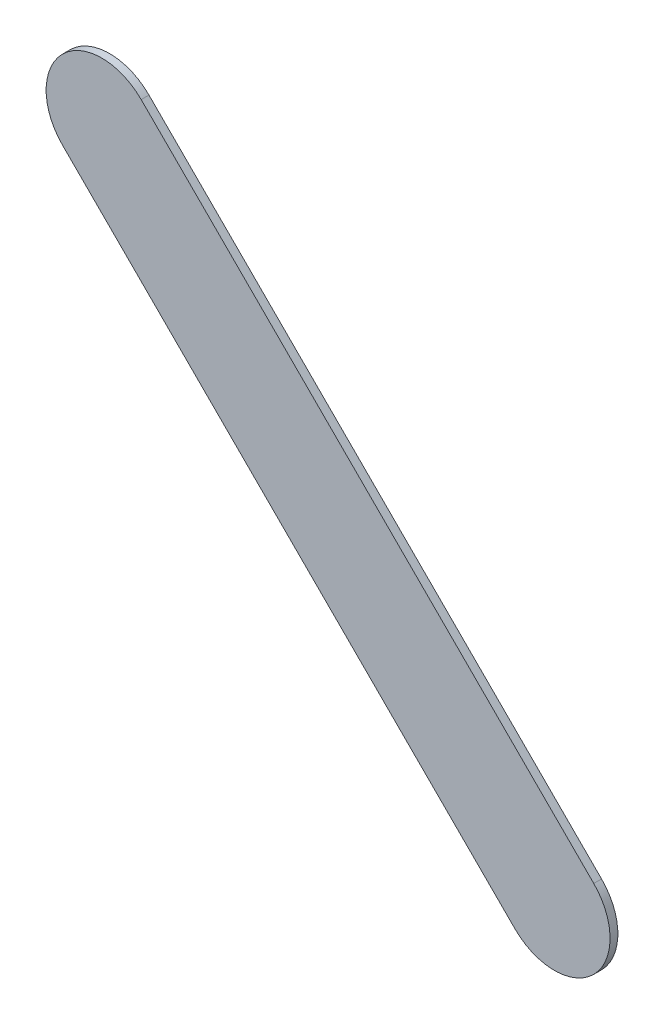
ISO-10303-21;
HEADER;
FILE_DESCRIPTION(('STEP AP214'),'2;1');
FILE_NAME('part.step','',(''),(''),'','','');
FILE_SCHEMA(('AUTOMOTIVE_DESIGN { 1 0 10303 214 1 1 1 1 }'));
ENDSEC;
DATA;
#1=APPLICATION_CONTEXT('core data for automotive mechanical design processes');
#2=APPLICATION_PROTOCOL_DEFINITION('international standard','automotive_design',2000,#1);
#3=PRODUCT_CONTEXT('',#1,'mechanical');
#4=PRODUCT('Part','Part','',(#3));
#5=PRODUCT_RELATED_PRODUCT_CATEGORY('part','',(#4));
#6=PRODUCT_DEFINITION_FORMATION('','',#4);
#7=PRODUCT_DEFINITION_CONTEXT('part definition',#1,'design');
#8=PRODUCT_DEFINITION('design','',#6,#7);
#9=PRODUCT_DEFINITION_SHAPE('','',#8);
#10=(LENGTH_UNIT() NAMED_UNIT(*) SI_UNIT(.MILLI.,.METRE.));
#11=(NAMED_UNIT(*) PLANE_ANGLE_UNIT() SI_UNIT($,.RADIAN.));
#12=(NAMED_UNIT(*) SI_UNIT($,.STERADIAN.) SOLID_ANGLE_UNIT());
#13=UNCERTAINTY_MEASURE_WITH_UNIT(LENGTH_MEASURE(1.E-05),#10,'distance_accuracy_value','');
#14=(GEOMETRIC_REPRESENTATION_CONTEXT(3) GLOBAL_UNCERTAINTY_ASSIGNED_CONTEXT((#13)) GLOBAL_UNIT_ASSIGNED_CONTEXT((#10,
#11,#12)) REPRESENTATION_CONTEXT('',''));
#15=CARTESIAN_POINT('',(0.,0.,0.));
#16=DIRECTION('',(0.,0.,1.));
#17=DIRECTION('',(1.,0.,0.));
#18=AXIS2_PLACEMENT_3D('',#15,#16,#17);
#19=CARTESIAN_POINT('',(173.404776,-91.771223,0.));
#20=DIRECTION('',(0.,0.,1.));
#21=DIRECTION('',(1.,0.,0.));
#22=AXIS2_PLACEMENT_3D('',#19,#20,#21);
#23=PLANE('',#22);
#24=DIRECTION('',(-0.707106781186548,0.707106781186548,0.));
#25=VECTOR('',#24,1.);
#26=CARTESIAN_POINT('',(173.404776,-91.771223,0.));
#27=LINE('',#26,#25);
#28=CARTESIAN_POINT('',(173.404776,-91.771223,0.));
#29=VERTEX_POINT('',#28);
#30=CARTESIAN_POINT('',(171.372776,-89.739223,0.));
#31=VERTEX_POINT('',#30);
#32=EDGE_CURVE('E79',#29,#31,#27,.T.);
#33=ORIENTED_EDGE('',*,*,#32,.T.);
#34=CARTESIAN_POINT('',(171.1959995,-89.9159995,0.));
#35=DIRECTION('',(0.,0.,1.));
#36=DIRECTION('',(0.707106781186548,0.707106781186548,0.));
#37=AXIS2_PLACEMENT_3D('',#34,#35,#36);
#38=CIRCLE('',#37,0.249999723809);
#39=CARTESIAN_POINT('',(171.019223,-90.092776,0.));
#40=VERTEX_POINT('',#39);
#41=EDGE_CURVE('E77',#31,#40,#38,.T.);
#42=ORIENTED_EDGE('',*,*,#41,.T.);
#43=DIRECTION('',(0.707106781186548,-0.707106781186548,0.));
#44=VECTOR('',#43,1.);
#45=CARTESIAN_POINT('',(171.019223,-90.092776,0.));
#46=LINE('',#45,#44);
#47=CARTESIAN_POINT('',(173.051223,-92.124776,0.));
#48=VERTEX_POINT('',#47);
#49=EDGE_CURVE('E65',#40,#48,#46,.T.);
#50=ORIENTED_EDGE('',*,*,#49,.T.);
#51=CARTESIAN_POINT('',(173.2279995,-91.9479995,0.));
#52=DIRECTION('',(0.,0.,1.));
#53=DIRECTION('',(-0.707106781187048,-0.707106781186048,0.));
#54=AXIS2_PLACEMENT_3D('',#51,#52,#53);
#55=CIRCLE('',#54,0.249999723809);
#56=EDGE_CURVE('E11',#48,#29,#55,.T.);
#57=ORIENTED_EDGE('',*,*,#56,.T.);
#58=EDGE_LOOP('',(#33,#42,#50,#57));
#59=FACE_BOUND('',#58,.T.);
#60=ADVANCED_FACE('F17',(#59),#23,.T.);
#61=CARTESIAN_POINT('',(173.404776,-91.771223,-0.035));
#62=DIRECTION('',(0.,0.,1.));
#63=DIRECTION('',(1.,0.,0.));
#64=AXIS2_PLACEMENT_3D('',#61,#62,#63);
#65=PLANE('',#64);
#66=CARTESIAN_POINT('',(173.2279995,-91.9479995,-0.035));
#67=DIRECTION('',(0.,0.,1.));
#68=DIRECTION('',(-0.707106781187048,-0.707106781186048,0.));
#69=AXIS2_PLACEMENT_3D('',#66,#67,#68);
#70=CIRCLE('',#69,0.249999723809);
#71=CARTESIAN_POINT('',(173.051223,-92.124776,-0.035));
#72=VERTEX_POINT('',#71);
#73=CARTESIAN_POINT('',(173.404776,-91.771223,-0.035));
#74=VERTEX_POINT('',#73);
#75=EDGE_CURVE('E26',#72,#74,#70,.T.);
#76=ORIENTED_EDGE('',*,*,#75,.F.);
#77=DIRECTION('',(0.707106781186548,-0.707106781186548,0.));
#78=VECTOR('',#77,1.);
#79=CARTESIAN_POINT('',(171.019223,-90.092776,-0.035));
#80=LINE('',#79,#78);
#81=CARTESIAN_POINT('',(171.019223,-90.092776,-0.035));
#82=VERTEX_POINT('',#81);
#83=EDGE_CURVE('E84',#82,#72,#80,.T.);
#84=ORIENTED_EDGE('',*,*,#83,.F.);
#85=CARTESIAN_POINT('',(171.1959995,-89.9159995,-0.035));
#86=DIRECTION('',(0.,0.,1.));
#87=DIRECTION('',(0.707106781186548,0.707106781186548,0.));
#88=AXIS2_PLACEMENT_3D('',#85,#86,#87);
#89=CIRCLE('',#88,0.249999723809);
#90=CARTESIAN_POINT('',(171.372776,-89.739223,-0.035));
#91=VERTEX_POINT('',#90);
#92=EDGE_CURVE('E87',#91,#82,#89,.T.);
#93=ORIENTED_EDGE('',*,*,#92,.F.);
#94=DIRECTION('',(-0.707106781186548,0.707106781186548,0.));
#95=VECTOR('',#94,1.);
#96=CARTESIAN_POINT('',(173.404776,-91.771223,-0.035));
#97=LINE('',#96,#95);
#98=EDGE_CURVE('E98',#74,#91,#97,.T.);
#99=ORIENTED_EDGE('',*,*,#98,.F.);
#100=EDGE_LOOP('',(#76,#84,#93,#99));
#101=FACE_BOUND('',#100,.T.);
#102=ADVANCED_FACE('F119',(#101),#65,.F.);
#103=CARTESIAN_POINT('',(173.2279995,-91.9479995,-0.035));
#104=DIRECTION('',(0.,0.,-1.));
#105=DIRECTION('',(-0.707106781187048,-0.707106781186048,0.));
#106=AXIS2_PLACEMENT_3D('',#103,#104,#105);
#107=CYLINDRICAL_SURFACE('',#106,0.249999723809);
#108=ORIENTED_EDGE('',*,*,#75,.T.);
#109=DIRECTION('',(0.,0.,1.));
#110=VECTOR('',#109,1.);
#111=CARTESIAN_POINT('',(173.404776,-91.771223,-0.035));
#112=LINE('',#111,#110);
#113=EDGE_CURVE('E94',#74,#29,#112,.T.);
#114=ORIENTED_EDGE('',*,*,#113,.T.);
#115=ORIENTED_EDGE('',*,*,#56,.F.);
#116=DIRECTION('',(0.,0.,1.));
#117=VECTOR('',#116,1.);
#118=CARTESIAN_POINT('',(173.051223,-92.124776,-0.035));
#119=LINE('',#118,#117);
#120=EDGE_CURVE('E72',#72,#48,#119,.T.);
#121=ORIENTED_EDGE('',*,*,#120,.F.);
#122=EDGE_LOOP('',(#108,#114,#115,#121));
#123=FACE_BOUND('',#122,.T.);
#124=ADVANCED_FACE('F113',(#123),#107,.T.);
#125=CARTESIAN_POINT('',(171.019223,-90.092776,-0.035));
#126=DIRECTION('',(0.707106781186548,0.707106781186548,0.));
#127=DIRECTION('',(0.,0.,-1.));
#128=AXIS2_PLACEMENT_3D('',#125,#126,#127);
#129=PLANE('',#128);
#130=ORIENTED_EDGE('',*,*,#83,.T.);
#131=ORIENTED_EDGE('',*,*,#120,.T.);
#132=ORIENTED_EDGE('',*,*,#49,.F.);
#133=DIRECTION('',(0.,0.,1.));
#134=VECTOR('',#133,1.);
#135=CARTESIAN_POINT('',(171.019223,-90.092776,-0.035));
#136=LINE('',#135,#134);
#137=EDGE_CURVE('E70',#82,#40,#136,.T.);
#138=ORIENTED_EDGE('',*,*,#137,.F.);
#139=EDGE_LOOP('',(#130,#131,#132,#138));
#140=FACE_BOUND('',#139,.T.);
#141=ADVANCED_FACE('F68',(#140),#129,.F.);
#142=CARTESIAN_POINT('',(171.1959995,-89.9159995,-0.035));
#143=DIRECTION('',(0.,0.,-1.));
#144=DIRECTION('',(0.707106781186548,0.707106781186548,0.));
#145=AXIS2_PLACEMENT_3D('',#142,#143,#144);
#146=CYLINDRICAL_SURFACE('',#145,0.249999723809);
#147=ORIENTED_EDGE('',*,*,#92,.T.);
#148=ORIENTED_EDGE('',*,*,#137,.T.);
#149=ORIENTED_EDGE('',*,*,#41,.F.);
#150=DIRECTION('',(0.,0.,1.));
#151=VECTOR('',#150,1.);
#152=CARTESIAN_POINT('',(171.372776,-89.739223,-0.035));
#153=LINE('',#152,#151);
#154=EDGE_CURVE('E101',#91,#31,#153,.T.);
#155=ORIENTED_EDGE('',*,*,#154,.F.);
#156=EDGE_LOOP('',(#147,#148,#149,#155));
#157=FACE_BOUND('',#156,.T.);
#158=ADVANCED_FACE('F86',(#157),#146,.T.);
#159=CARTESIAN_POINT('',(173.404776,-91.771223,-0.035));
#160=DIRECTION('',(-0.707106781186548,-0.707106781186548,0.));
#161=DIRECTION('',(-0.707106781186548,0.707106781186548,0.));
#162=AXIS2_PLACEMENT_3D('',#159,#160,#161);
#163=PLANE('',#162);
#164=ORIENTED_EDGE('',*,*,#98,.T.);
#165=ORIENTED_EDGE('',*,*,#154,.T.);
#166=ORIENTED_EDGE('',*,*,#32,.F.);
#167=ORIENTED_EDGE('',*,*,#113,.F.);
#168=EDGE_LOOP('',(#164,#165,#166,#167));
#169=FACE_BOUND('',#168,.T.);
#170=ADVANCED_FACE('F118',(#169),#163,.F.);
#171=CLOSED_SHELL('',(#60,#102,#124,#141,#158,#170));
#172=MANIFOLD_SOLID_BREP('B1',#171);
#173=ADVANCED_BREP_SHAPE_REPRESENTATION('',(#18,#172),#14);
#174=SHAPE_DEFINITION_REPRESENTATION(#9,#173);
ENDSEC;
END-ISO-10303-21;
